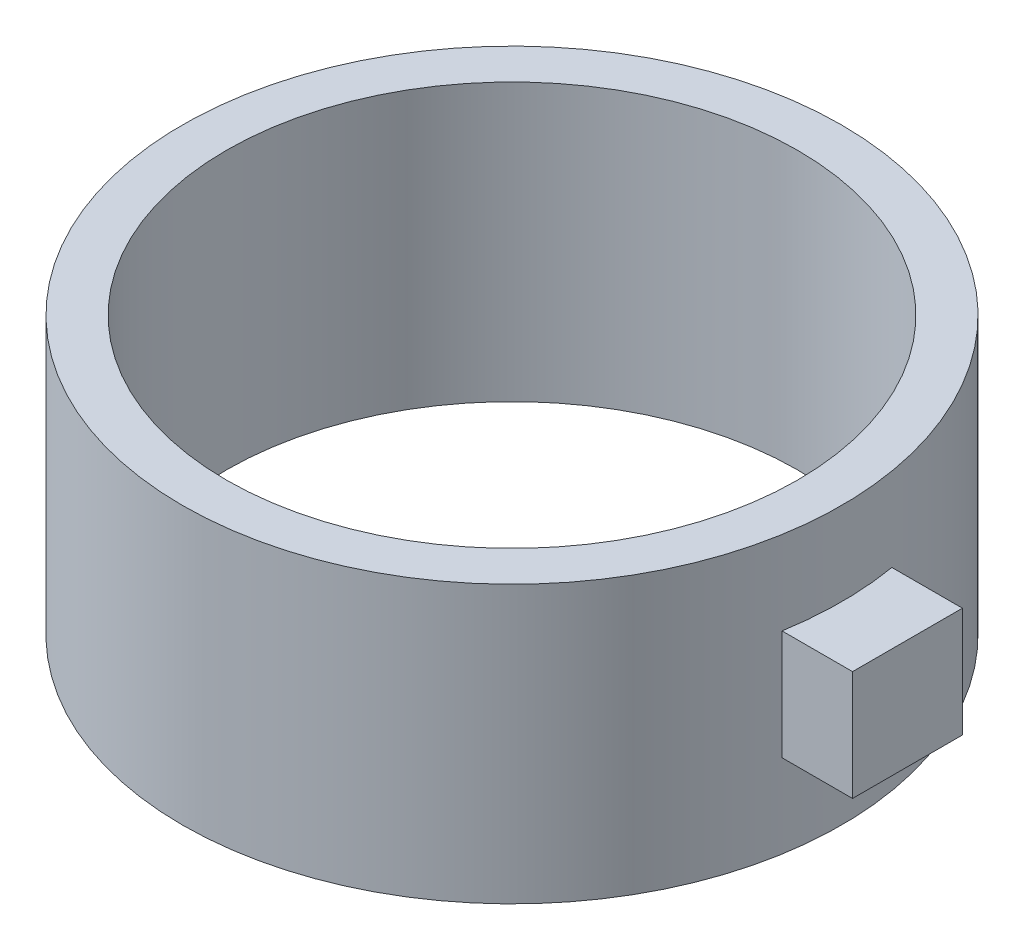
ISO-10303-21;
HEADER;
FILE_DESCRIPTION(('STEP AP214'),'2;1');
FILE_NAME('part.step','',(''),(''),'','','');
FILE_SCHEMA(('AUTOMOTIVE_DESIGN { 1 0 10303 214 1 1 1 1 }'));
ENDSEC;
DATA;
#1=APPLICATION_CONTEXT('core data for automotive mechanical design processes');
#2=APPLICATION_PROTOCOL_DEFINITION('international standard','automotive_design',2000,#1);
#3=PRODUCT_CONTEXT('',#1,'mechanical');
#4=PRODUCT('Part','Part','',(#3));
#5=PRODUCT_RELATED_PRODUCT_CATEGORY('part','',(#4));
#6=PRODUCT_DEFINITION_FORMATION('','',#4);
#7=PRODUCT_DEFINITION_CONTEXT('part definition',#1,'design');
#8=PRODUCT_DEFINITION('design','',#6,#7);
#9=PRODUCT_DEFINITION_SHAPE('','',#8);
#10=(LENGTH_UNIT() NAMED_UNIT(*) SI_UNIT(.MILLI.,.METRE.));
#11=(NAMED_UNIT(*) PLANE_ANGLE_UNIT() SI_UNIT($,.RADIAN.));
#12=(NAMED_UNIT(*) SI_UNIT($,.STERADIAN.) SOLID_ANGLE_UNIT());
#13=UNCERTAINTY_MEASURE_WITH_UNIT(LENGTH_MEASURE(1.E-05),#10,'distance_accuracy_value','');
#14=(GEOMETRIC_REPRESENTATION_CONTEXT(3) GLOBAL_UNCERTAINTY_ASSIGNED_CONTEXT((#13)) GLOBAL_UNIT_ASSIGNED_CONTEXT((#10,
#11,#12)) REPRESENTATION_CONTEXT('',''));
#15=CARTESIAN_POINT('',(0.,0.,0.));
#16=DIRECTION('',(0.,0.,1.));
#17=DIRECTION('',(1.,0.,0.));
#18=AXIS2_PLACEMENT_3D('',#15,#16,#17);
#19=CARTESIAN_POINT('',(2.54360968138606,12.6,2.54360968138607));
#20=DIRECTION('',(0.,1.,0.));
#21=DIRECTION('',(0.,0.,1.));
#22=AXIS2_PLACEMENT_3D('',#19,#20,#21);
#23=PLANE('',#22);
#24=CARTESIAN_POINT('',(2.54360968138606,12.6,2.54360968138607));
#25=DIRECTION('',(0.,1.,0.));
#26=DIRECTION('',(0.,0.,1.));
#27=AXIS2_PLACEMENT_3D('',#24,#25,#26);
#28=CIRCLE('',#27,15.);
#29=CARTESIAN_POINT('',(2.54360968138606,12.6,17.5436096813861));
#30=VERTEX_POINT('',#29);
#31=EDGE_CURVE('E118',#30,#30,#28,.T.);
#32=ORIENTED_EDGE('',*,*,#31,.T.);
#33=EDGE_LOOP('',(#32));
#34=FACE_BOUND('',#33,.T.);
#35=CARTESIAN_POINT('',(2.54360968138606,12.6,2.54360968138607));
#36=DIRECTION('',(0.,1.,0.));
#37=DIRECTION('',(0.,0.,1.));
#38=AXIS2_PLACEMENT_3D('',#35,#36,#37);
#39=CIRCLE('',#38,13.);
#40=CARTESIAN_POINT('',(2.54360968138606,12.6,15.5436096813861));
#41=VERTEX_POINT('',#40);
#42=EDGE_CURVE('E112',#41,#41,#39,.T.);
#43=ORIENTED_EDGE('',*,*,#42,.F.);
#44=EDGE_LOOP('',(#43));
#45=FACE_BOUND('',#44,.T.);
#46=ADVANCED_FACE('F43',(#34,#45),#23,.T.);
#47=CARTESIAN_POINT('',(2.54360968138606,0.,2.54360968138607));
#48=DIRECTION('',(0.,1.,0.));
#49=DIRECTION('',(0.,0.,1.));
#50=AXIS2_PLACEMENT_3D('',#47,#48,#49);
#51=PLANE('',#50);
#52=CARTESIAN_POINT('',(2.54360968138606,0.,2.54360968138607));
#53=DIRECTION('',(0.,1.,0.));
#54=DIRECTION('',(0.,0.,1.));
#55=AXIS2_PLACEMENT_3D('',#52,#53,#54);
#56=CIRCLE('',#55,15.);
#57=CARTESIAN_POINT('',(2.54360968138606,0.,17.5436096813861));
#58=VERTEX_POINT('',#57);
#59=EDGE_CURVE('E115',#58,#58,#56,.T.);
#60=ORIENTED_EDGE('',*,*,#59,.F.);
#61=EDGE_LOOP('',(#60));
#62=FACE_BOUND('',#61,.T.);
#63=CARTESIAN_POINT('',(2.54360968138606,0.,2.54360968138607));
#64=DIRECTION('',(0.,1.,0.));
#65=DIRECTION('',(0.,0.,1.));
#66=AXIS2_PLACEMENT_3D('',#63,#64,#65);
#67=CIRCLE('',#66,13.);
#68=CARTESIAN_POINT('',(2.54360968138606,0.,15.5436096813861));
#69=VERTEX_POINT('',#68);
#70=EDGE_CURVE('E108',#69,#69,#67,.T.);
#71=ORIENTED_EDGE('',*,*,#70,.T.);
#72=EDGE_LOOP('',(#71));
#73=FACE_BOUND('',#72,.T.);
#74=ADVANCED_FACE('F142',(#62,#73),#51,.F.);
#75=CARTESIAN_POINT('',(2.54360968138606,12.6,2.54360968138607));
#76=DIRECTION('',(0.,-1.,0.));
#77=DIRECTION('',(0.,0.,-1.));
#78=AXIS2_PLACEMENT_3D('',#75,#76,#77);
#79=CYLINDRICAL_SURFACE('',#78,15.);
#80=CARTESIAN_POINT('',(2.54360968138606,3.8,2.54360968138607));
#81=DIRECTION('',(0.,-1.,0.));
#82=DIRECTION('',(0.,0.,-1.));
#83=AXIS2_PLACEMENT_3D('',#80,#81,#82);
#84=CIRCLE('',#83,15.);
#85=CARTESIAN_POINT('',(17.3338091391351,3.8,0.0436096813860661));
#86=VERTEX_POINT('',#85);
#87=CARTESIAN_POINT('',(17.3338091391351,3.8,5.04360968138607));
#88=VERTEX_POINT('',#87);
#89=EDGE_CURVE('E121',#86,#88,#84,.T.);
#90=ORIENTED_EDGE('',*,*,#89,.T.);
#91=DIRECTION('',(0.,-1.,0.));
#92=VECTOR('',#91,1.);
#93=CARTESIAN_POINT('',(17.3338091391351,12.6,5.0436096813861));
#94=LINE('',#93,#92);
#95=CARTESIAN_POINT('',(17.3338091391351,8.8,5.04360968138608));
#96=VERTEX_POINT('',#95);
#97=EDGE_CURVE('E12',#88,#96,#94,.F.);
#98=ORIENTED_EDGE('',*,*,#97,.T.);
#99=CARTESIAN_POINT('',(2.54360968138606,8.8,2.54360968138607));
#100=DIRECTION('',(0.,1.,0.));
#101=DIRECTION('',(0.,0.,1.));
#102=AXIS2_PLACEMENT_3D('',#99,#100,#101);
#103=CIRCLE('',#102,15.);
#104=CARTESIAN_POINT('',(17.3338091391351,8.8,0.0436096813860835));
#105=VERTEX_POINT('',#104);
#106=EDGE_CURVE('E51',#96,#105,#103,.T.);
#107=ORIENTED_EDGE('',*,*,#106,.T.);
#108=DIRECTION('',(0.,-1.,0.));
#109=VECTOR('',#108,1.);
#110=CARTESIAN_POINT('',(17.3338091391351,12.6,0.0436096813860969));
#111=LINE('',#110,#109);
#112=EDGE_CURVE('E125',#105,#86,#111,.T.);
#113=ORIENTED_EDGE('',*,*,#112,.T.);
#114=EDGE_LOOP('',(#90,#98,#107,#113));
#115=FACE_BOUND('',#114,.T.);
#116=ORIENTED_EDGE('',*,*,#31,.F.);
#117=EDGE_LOOP('',(#116));
#118=FACE_BOUND('',#117,.T.);
#119=ORIENTED_EDGE('',*,*,#59,.T.);
#120=EDGE_LOOP('',(#119));
#121=FACE_BOUND('',#120,.T.);
#122=ADVANCED_FACE('F45',(#115,#118,#121),#79,.T.);
#123=CARTESIAN_POINT('',(2.54360968138606,12.6,2.54360968138607));
#124=DIRECTION('',(0.,-1.,0.));
#125=DIRECTION('',(0.,0.,-1.));
#126=AXIS2_PLACEMENT_3D('',#123,#124,#125);
#127=CYLINDRICAL_SURFACE('',#126,13.);
#128=ORIENTED_EDGE('',*,*,#42,.T.);
#129=EDGE_LOOP('',(#128));
#130=FACE_BOUND('',#129,.T.);
#131=ORIENTED_EDGE('',*,*,#70,.F.);
#132=EDGE_LOOP('',(#131));
#133=FACE_BOUND('',#132,.T.);
#134=ADVANCED_FACE('F139',(#130,#133),#127,.F.);
#135=CARTESIAN_POINT('',(16.5436096813861,6.3,5.04360968138608));
#136=DIRECTION('',(0.,0.,1.));
#137=DIRECTION('',(0.,-1.,0.));
#138=AXIS2_PLACEMENT_3D('',#135,#136,#137);
#139=PLANE('',#138);
#140=ORIENTED_EDGE('',*,*,#97,.F.);
#141=DIRECTION('',(1.,0.,0.));
#142=VECTOR('',#141,1.);
#143=CARTESIAN_POINT('',(16.5436096813861,3.8,5.04360968138607));
#144=LINE('',#143,#142);
#145=CARTESIAN_POINT('',(20.5436096813861,3.8,5.04360968138607));
#146=VERTEX_POINT('',#145);
#147=EDGE_CURVE('E58',#88,#146,#144,.T.);
#148=ORIENTED_EDGE('',*,*,#147,.T.);
#149=DIRECTION('',(0.,-1.,0.));
#150=VECTOR('',#149,1.);
#151=CARTESIAN_POINT('',(20.5436096813861,6.3,5.04360968138608));
#152=LINE('',#151,#150);
#153=CARTESIAN_POINT('',(20.5436096813861,8.8,5.04360968138608));
#154=VERTEX_POINT('',#153);
#155=EDGE_CURVE('E85',#154,#146,#152,.T.);
#156=ORIENTED_EDGE('',*,*,#155,.F.);
#157=DIRECTION('',(1.,0.,0.));
#158=VECTOR('',#157,1.);
#159=CARTESIAN_POINT('',(16.5436096813861,8.8,5.04360968138608));
#160=LINE('',#159,#158);
#161=EDGE_CURVE('E106',#96,#154,#160,.T.);
#162=ORIENTED_EDGE('',*,*,#161,.F.);
#163=EDGE_LOOP('',(#140,#148,#156,#162));
#164=FACE_BOUND('',#163,.T.);
#165=ADVANCED_FACE('F83',(#164),#139,.T.);
#166=CARTESIAN_POINT('',(16.5436096813861,8.8,5.04360968138608));
#167=DIRECTION('',(0.,1.,0.));
#168=DIRECTION('',(0.,0.,1.));
#169=AXIS2_PLACEMENT_3D('',#166,#167,#168);
#170=PLANE('',#169);
#171=ORIENTED_EDGE('',*,*,#106,.F.);
#172=ORIENTED_EDGE('',*,*,#161,.T.);
#173=DIRECTION('',(0.,0.,1.));
#174=VECTOR('',#173,1.);
#175=CARTESIAN_POINT('',(20.5436096813861,8.8,5.04360968138608));
#176=LINE('',#175,#174);
#177=CARTESIAN_POINT('',(20.5436096813861,8.8,0.0436096813860835));
#178=VERTEX_POINT('',#177);
#179=EDGE_CURVE('E89',#178,#154,#176,.T.);
#180=ORIENTED_EDGE('',*,*,#179,.F.);
#181=DIRECTION('',(1.,0.,0.));
#182=VECTOR('',#181,1.);
#183=CARTESIAN_POINT('',(16.5436096813861,8.8,0.0436096813860835));
#184=LINE('',#183,#182);
#185=EDGE_CURVE('E109',#105,#178,#184,.T.);
#186=ORIENTED_EDGE('',*,*,#185,.F.);
#187=EDGE_LOOP('',(#171,#172,#180,#186));
#188=FACE_BOUND('',#187,.T.);
#189=ADVANCED_FACE('F131',(#188),#170,.T.);
#190=CARTESIAN_POINT('',(16.5436096813861,6.3,0.0436096813860747));
#191=DIRECTION('',(0.,0.,-1.));
#192=DIRECTION('',(0.,1.,0.));
#193=AXIS2_PLACEMENT_3D('',#190,#191,#192);
#194=PLANE('',#193);
#195=ORIENTED_EDGE('',*,*,#112,.F.);
#196=ORIENTED_EDGE('',*,*,#185,.T.);
#197=DIRECTION('',(0.,1.,0.));
#198=VECTOR('',#197,1.);
#199=CARTESIAN_POINT('',(20.5436096813861,6.3,0.0436096813860747));
#200=LINE('',#199,#198);
#201=CARTESIAN_POINT('',(20.5436096813861,3.8,0.043609681386066));
#202=VERTEX_POINT('',#201);
#203=EDGE_CURVE('E98',#202,#178,#200,.T.);
#204=ORIENTED_EDGE('',*,*,#203,.F.);
#205=DIRECTION('',(1.,0.,0.));
#206=VECTOR('',#205,1.);
#207=CARTESIAN_POINT('',(16.5436096813861,3.8,0.043609681386066));
#208=LINE('',#207,#206);
#209=EDGE_CURVE('E88',#86,#202,#208,.T.);
#210=ORIENTED_EDGE('',*,*,#209,.F.);
#211=EDGE_LOOP('',(#195,#196,#204,#210));
#212=FACE_BOUND('',#211,.T.);
#213=ADVANCED_FACE('F130',(#212),#194,.T.);
#214=CARTESIAN_POINT('',(16.5436096813861,3.8,0.043609681386066));
#215=DIRECTION('',(0.,-1.,0.));
#216=DIRECTION('',(0.,0.,-1.));
#217=AXIS2_PLACEMENT_3D('',#214,#215,#216);
#218=PLANE('',#217);
#219=ORIENTED_EDGE('',*,*,#89,.F.);
#220=ORIENTED_EDGE('',*,*,#209,.T.);
#221=DIRECTION('',(0.,0.,-1.));
#222=VECTOR('',#221,1.);
#223=CARTESIAN_POINT('',(20.5436096813861,3.8,0.043609681386066));
#224=LINE('',#223,#222);
#225=EDGE_CURVE('E92',#146,#202,#224,.T.);
#226=ORIENTED_EDGE('',*,*,#225,.F.);
#227=ORIENTED_EDGE('',*,*,#147,.F.);
#228=EDGE_LOOP('',(#219,#220,#226,#227));
#229=FACE_BOUND('',#228,.T.);
#230=ADVANCED_FACE('F93',(#229),#218,.T.);
#231=CARTESIAN_POINT('',(20.5436096813861,3.8,5.04360968138607));
#232=DIRECTION('',(-1.,0.,0.));
#233=DIRECTION('',(0.,0.,1.));
#234=AXIS2_PLACEMENT_3D('',#231,#232,#233);
#235=PLANE('',#234);
#236=ORIENTED_EDGE('',*,*,#155,.T.);
#237=ORIENTED_EDGE('',*,*,#225,.T.);
#238=ORIENTED_EDGE('',*,*,#203,.T.);
#239=ORIENTED_EDGE('',*,*,#179,.T.);
#240=EDGE_LOOP('',(#236,#237,#238,#239));
#241=FACE_BOUND('',#240,.T.);
#242=ADVANCED_FACE('F100',(#241),#235,.F.);
#243=CLOSED_SHELL('',(#46,#74,#122,#134,#165,#189,#213,#230,#242));
#244=MANIFOLD_SOLID_BREP('B2',#243);
#245=ADVANCED_BREP_SHAPE_REPRESENTATION('',(#18,#244),#14);
#246=SHAPE_DEFINITION_REPRESENTATION(#9,#245);
ENDSEC;
END-ISO-10303-21;
